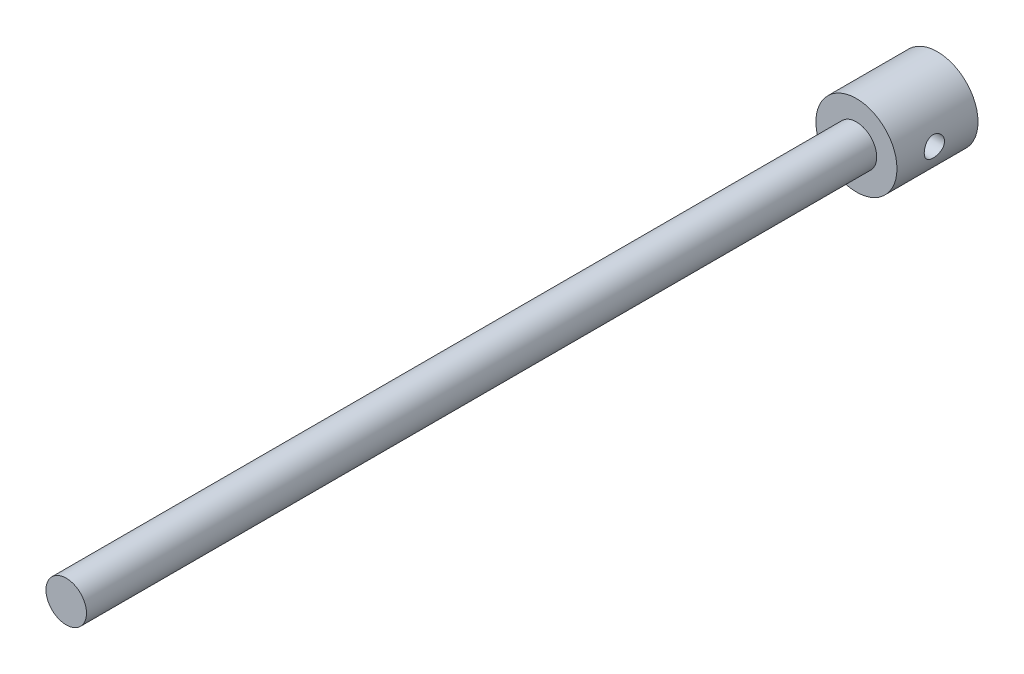
ISO-10303-21;
HEADER;
FILE_DESCRIPTION(('STEP AP214'),'2;1');
FILE_NAME('part.step','',(''),(''),'','','');
FILE_SCHEMA(('AUTOMOTIVE_DESIGN { 1 0 10303 214 1 1 1 1 }'));
ENDSEC;
DATA;
#1=APPLICATION_CONTEXT('core data for automotive mechanical design processes');
#2=APPLICATION_PROTOCOL_DEFINITION('international standard','automotive_design',2000,#1);
#3=PRODUCT_CONTEXT('',#1,'mechanical');
#4=PRODUCT('Part','Part','',(#3));
#5=PRODUCT_RELATED_PRODUCT_CATEGORY('part','',(#4));
#6=PRODUCT_DEFINITION_FORMATION('','',#4);
#7=PRODUCT_DEFINITION_CONTEXT('part definition',#1,'design');
#8=PRODUCT_DEFINITION('design','',#6,#7);
#9=PRODUCT_DEFINITION_SHAPE('','',#8);
#10=(LENGTH_UNIT() NAMED_UNIT(*) SI_UNIT(.MILLI.,.METRE.));
#11=(NAMED_UNIT(*) PLANE_ANGLE_UNIT() SI_UNIT($,.RADIAN.));
#12=(NAMED_UNIT(*) SI_UNIT($,.STERADIAN.) SOLID_ANGLE_UNIT());
#13=UNCERTAINTY_MEASURE_WITH_UNIT(LENGTH_MEASURE(1.E-05),#10,'distance_accuracy_value','');
#14=(GEOMETRIC_REPRESENTATION_CONTEXT(3) GLOBAL_UNCERTAINTY_ASSIGNED_CONTEXT((#13)) GLOBAL_UNIT_ASSIGNED_CONTEXT((#10,
#11,#12)) REPRESENTATION_CONTEXT('',''));
#15=CARTESIAN_POINT('',(0.,0.,0.));
#16=DIRECTION('',(0.,0.,1.));
#17=DIRECTION('',(1.,0.,0.));
#18=AXIS2_PLACEMENT_3D('',#15,#16,#17);
#19=CARTESIAN_POINT('',(0.,0.,50.8));
#20=DIRECTION('',(0.,0.,1.));
#21=DIRECTION('',(1.,0.,0.));
#22=AXIS2_PLACEMENT_3D('',#19,#20,#21);
#23=PLANE('',#22);
#24=CARTESIAN_POINT('',(0.,0.,50.8));
#25=DIRECTION('',(0.,0.,1.));
#26=DIRECTION('',(1.,0.,0.));
#27=AXIS2_PLACEMENT_3D('',#24,#25,#26);
#28=CIRCLE('',#27,25.4);
#29=CARTESIAN_POINT('',(25.4,0.,50.8));
#30=VERTEX_POINT('',#29);
#31=EDGE_CURVE('E47',#30,#30,#28,.T.);
#32=ORIENTED_EDGE('',*,*,#31,.T.);
#33=EDGE_LOOP('',(#32));
#34=FACE_BOUND('',#33,.T.);
#35=CARTESIAN_POINT('',(0.,0.,50.8));
#36=DIRECTION('',(0.,0.,1.));
#37=DIRECTION('',(1.,0.,0.));
#38=AXIS2_PLACEMENT_3D('',#35,#36,#37);
#39=CIRCLE('',#38,12.7);
#40=CARTESIAN_POINT('',(12.7,0.,50.8));
#41=VERTEX_POINT('',#40);
#42=EDGE_CURVE('E83',#41,#41,#39,.T.);
#43=ORIENTED_EDGE('',*,*,#42,.F.);
#44=EDGE_LOOP('',(#43));
#45=FACE_BOUND('',#44,.T.);
#46=ADVANCED_FACE('F32',(#34,#45),#23,.T.);
#47=CARTESIAN_POINT('',(0.,0.,50.8));
#48=DIRECTION('',(0.,0.,-1.));
#49=DIRECTION('',(-1.,0.,0.));
#50=AXIS2_PLACEMENT_3D('',#47,#48,#49);
#51=CYLINDRICAL_SURFACE('',#50,25.4);
#52=CARTESIAN_POINT('',(-25.4,0.,20.9972854039717));
#53=CARTESIAN_POINT('',(-25.4000031710595,0.175477368335688,20.997280166308));
#54=CARTESIAN_POINT('',(-25.3981788556915,0.350897420818033,21.0045602548995));
#55=CARTESIAN_POINT('',(-25.3909395099852,0.700509078087222,21.033607257939));
#56=CARTESIAN_POINT('',(-25.3855240699658,0.874700540422952,21.0553758252559));
#57=CARTESIAN_POINT('',(-25.3712464324763,1.22059137272975,21.1132318736652));
#58=CARTESIAN_POINT('',(-25.3623831657437,1.3922899524397,21.1493237968806));
#59=CARTESIAN_POINT('',(-25.3414514847781,1.73199424315671,21.2355415609955));
#60=CARTESIAN_POINT('',(-25.3293818893422,1.89999856846248,21.2856725742277));
#61=CARTESIAN_POINT('',(-25.3023903485221,2.23081734458719,21.3994702721412));
#62=CARTESIAN_POINT('',(-25.2874729817979,2.39363964336374,21.4631152472046));
#63=CARTESIAN_POINT('',(-25.2551699495027,2.71334043544166,21.6035256297834));
#64=CARTESIAN_POINT('',(-25.2377833730272,2.87021670804385,21.6802958814228));
#65=CARTESIAN_POINT('',(-25.2010173505744,3.17688024593829,21.8463468092333));
#66=CARTESIAN_POINT('',(-25.1816386304114,3.32667006425748,21.9356229333039));
#67=CARTESIAN_POINT('',(-25.141388997849,3.61832024042658,22.1261161881631));
#68=CARTESIAN_POINT('',(-25.1205175257531,3.76017758815662,22.2273378071717));
#69=CARTESIAN_POINT('',(-25.0774522474359,4.03750393287548,22.4429538330606));
#70=CARTESIAN_POINT('',(-25.0552413295654,4.17281051933205,22.5575537597602));
#71=CARTESIAN_POINT('',(-25.010449109414,4.43338729824146,22.7976723640145));
#72=CARTESIAN_POINT('',(-24.9878676727682,4.55865374829687,22.9231950769422));
#73=CARTESIAN_POINT('',(-24.942968931678,4.79824509746214,23.1842665554625));
#74=CARTESIAN_POINT('',(-24.9206515618085,4.91257275871294,23.3198127746237));
#75=CARTESIAN_POINT('',(-24.8768868272122,5.12959684750453,23.60013073647));
#76=CARTESIAN_POINT('',(-24.8554397867069,5.23228896555896,23.7449058664705));
#77=CARTESIAN_POINT('',(-24.8137286118806,5.42668438129292,24.0448627204062));
#78=CARTESIAN_POINT('',(-24.7934861842616,5.51820639937682,24.2001650567364));
#79=CARTESIAN_POINT('',(-24.755120552848,5.68784421693558,24.5182506665807));
#80=CARTESIAN_POINT('',(-24.7369981514456,5.76595494567319,24.6810367402941));
#81=CARTESIAN_POINT('',(-24.7034397392096,5.9080803961254,25.0128442277819));
#82=CARTESIAN_POINT('',(-24.68800239674,5.97210210939067,25.181862500042));
#83=CARTESIAN_POINT('',(-24.6602710489484,6.08558870998768,25.5249655674141));
#84=CARTESIAN_POINT('',(-24.6479781694714,6.13504838447488,25.6990521524086));
#85=CARTESIAN_POINT('',(-24.6168789520224,6.25914374825844,26.2199716952779));
#86=CARTESIAN_POINT('',(-24.6031101485883,6.31252426947526,26.5725680653745));
#87=CARTESIAN_POINT('',(-24.5940009437438,6.34783939503414,27.1040258483282));
#88=CARTESIAN_POINT('',(-24.5928903401882,6.35214485658127,27.2816745339742));
#89=CARTESIAN_POINT('',(-24.5945073780102,6.34588277430792,27.6367137993253));
#90=CARTESIAN_POINT('',(-24.5972350573532,6.33531508337368,27.8141043764601));
#91=CARTESIAN_POINT('',(-24.6108806382161,6.282210717607,28.3352139185138));
#92=CARTESIAN_POINT('',(-24.6271165712381,6.21884460073213,28.6769036859868));
#93=CARTESIAN_POINT('',(-24.6721486694924,6.03768209721243,29.34446037229));
#94=CARTESIAN_POINT('',(-24.7009457295138,5.91988183292792,29.6703261620644));
#95=CARTESIAN_POINT('',(-24.7681803767332,5.63198220323522,30.301028542958));
#96=CARTESIAN_POINT('',(-24.8067123450231,5.46136691279107,30.6056196519554));
#97=CARTESIAN_POINT('',(-24.8890242769867,5.07304154695446,31.1823451552136));
#98=CARTESIAN_POINT('',(-24.9328051583941,4.8553232305771,31.4544738570211));
#99=CARTESIAN_POINT('',(-25.0222123177803,4.37160850403657,31.966712960824));
#100=CARTESIAN_POINT('',(-25.0678556192047,4.10441249538152,32.2056891228183));
#101=CARTESIAN_POINT('',(-25.1547191981976,3.5331904482862,32.6356556194909));
#102=CARTESIAN_POINT('',(-25.1959393406395,3.22916328526542,32.8266444884062));
#103=CARTESIAN_POINT('',(-25.2695173289519,2.5912905991288,33.1556328120175));
#104=CARTESIAN_POINT('',(-25.3018442485759,2.25734624362244,33.293448007071));
#105=CARTESIAN_POINT('',(-25.3537684828018,1.57004175543464,33.5106686687859));
#106=CARTESIAN_POINT('',(-25.3733682323211,1.21668535063703,33.5900853084389));
#107=CARTESIAN_POINT('',(-25.3972694779652,0.510285919246605,33.6865224877304));
#108=CARTESIAN_POINT('',(-25.4019496302995,0.157466278971067,33.7050877734938));
#109=CARTESIAN_POINT('',(-25.3965627053655,-0.546239334332573,33.6835310694871));
#110=CARTESIAN_POINT('',(-25.3864969556011,-0.897125478569813,33.6434143625799));
#111=CARTESIAN_POINT('',(-25.3529923842754,-1.58163313415953,33.5069093927739));
#112=CARTESIAN_POINT('',(-25.3297539457695,-1.91543343305329,33.4113638153538));
#113=CARTESIAN_POINT('',(-25.2725214822312,-2.56225810885606,33.1676623211708));
#114=CARTESIAN_POINT('',(-25.2385263710238,-2.87528038380228,33.0195010912601));
#115=CARTESIAN_POINT('',(-25.1626516754406,-3.47777277441651,32.6718308709794));
#116=CARTESIAN_POINT('',(-25.1206428888929,-3.76672640787545,32.4714573908038));
#117=CARTESIAN_POINT('',(-25.0335780508423,-4.30756129917307,32.0259639197861));
#118=CARTESIAN_POINT('',(-24.9885214742832,-4.55943614542403,31.7808362065123));
#119=CARTESIAN_POINT('',(-24.9217589766669,-4.90717834470799,31.3814434511164));
#120=CARTESIAN_POINT('',(-24.8993709370079,-5.0192686616051,31.2410911054496));
#121=CARTESIAN_POINT('',(-24.8557025906451,-5.23122685203937,30.9513021704156));
#122=CARTESIAN_POINT('',(-24.8344218821867,-5.33109917644899,30.8018689189871));
#123=CARTESIAN_POINT('',(-24.7935782927896,-5.51793758808666,30.4948531517416));
#124=CARTESIAN_POINT('',(-24.7740160378282,-5.6048989801736,30.3372676992805));
#125=CARTESIAN_POINT('',(-24.7372045033632,-5.76519514981392,30.015125966036));
#126=CARTESIAN_POINT('',(-24.7199542962693,-5.83853539673375,29.8505725158823));
#127=CARTESIAN_POINT('',(-24.688370583311,-5.97067425881328,29.5165316866408));
#128=CARTESIAN_POINT('',(-24.6740212417776,-6.02955222433233,29.3470772052707));
#129=CARTESIAN_POINT('',(-24.6485634010713,-6.1327931149458,29.0036330767994));
#130=CARTESIAN_POINT('',(-24.6374536551344,-6.17716162483007,28.8296452025397));
#131=CARTESIAN_POINT('',(-24.6188148175501,-6.25103277930087,28.4783493852618));
#132=CARTESIAN_POINT('',(-24.611285758278,-6.28053528947479,28.3010414122396));
#133=CARTESIAN_POINT('',(-24.6000476746204,-6.32441063496974,27.9444446873736));
#134=CARTESIAN_POINT('',(-24.5963385536064,-6.33878385299868,27.7651559857501));
#135=CARTESIAN_POINT('',(-24.5929088263029,-6.35207673174978,27.4111663244117));
#136=CARTESIAN_POINT('',(-24.5930759770304,-6.35143127769379,27.2364826341427));
#137=CARTESIAN_POINT('',(-24.5971190708759,-6.3357556112654,26.8877471817097));
#138=CARTESIAN_POINT('',(-24.600996219102,-6.32072072481373,26.7136956433268));
#139=CARTESIAN_POINT('',(-24.6123428121949,-6.27639249176991,26.367574631715));
#140=CARTESIAN_POINT('',(-24.6198115229946,-6.24710205880485,26.1955047608152));
#141=CARTESIAN_POINT('',(-24.6381175720356,-6.17450899931628,25.8545285221931));
#142=CARTESIAN_POINT('',(-24.6489549620895,-6.13120615727164,25.6856222031708));
#143=CARTESIAN_POINT('',(-24.6736066272614,-6.03123267697015,25.3531200226926));
#144=CARTESIAN_POINT('',(-24.6874031641975,-5.97464151000922,25.1894989265039));
#145=CARTESIAN_POINT('',(-24.7176104719978,-5.84841340880727,24.867683350238));
#146=CARTESIAN_POINT('',(-24.7340203907627,-5.77878072548574,24.7094871217321));
#147=CARTESIAN_POINT('',(-24.7690064248436,-5.62693434232342,24.3994177636436));
#148=CARTESIAN_POINT('',(-24.7875834904888,-5.54471511810796,24.2475474479912));
#149=CARTESIAN_POINT('',(-24.8263823783131,-5.36832253298905,23.9512086128987));
#150=CARTESIAN_POINT('',(-24.84660366037,-5.27415309205695,23.8067376879867));
#151=CARTESIAN_POINT('',(-24.888703750471,-5.07182215593831,23.5223177351342));
#152=CARTESIAN_POINT('',(-24.9106122575543,-4.96335638560902,23.3825894733589));
#153=CARTESIAN_POINT('',(-24.9549791760033,-4.73524098654736,23.1127613097511));
#154=CARTESIAN_POINT('',(-24.9774373980069,-4.61559517011177,22.9826581527607));
#155=CARTESIAN_POINT('',(-25.0223082296508,-4.3657987735358,22.7327945003161));
#156=CARTESIAN_POINT('',(-25.0447208045122,-4.23564203006343,22.6130401595829));
#157=CARTESIAN_POINT('',(-25.0888678391781,-3.96577795130731,22.3847935531931));
#158=CARTESIAN_POINT('',(-25.1106025427794,-3.82607410870019,22.2762972051483));
#159=CARTESIAN_POINT('',(-25.153203161619,-3.53530097597244,22.0693525237131));
#160=CARTESIAN_POINT('',(-25.1740455087074,-3.38406902835692,21.971127689351));
#161=CARTESIAN_POINT('',(-25.2138259224801,-3.07367149273699,21.7878321450601));
#162=CARTESIAN_POINT('',(-25.232764688416,-2.91450885032487,21.7027565987199));
#163=CARTESIAN_POINT('',(-25.2682002160175,-2.58935741637065,21.5464021967284));
#164=CARTESIAN_POINT('',(-25.2846980295753,-2.42337160480888,21.4751173940637));
#165=CARTESIAN_POINT('',(-25.3147861314922,-2.08575276937432,21.346888511075));
#166=CARTESIAN_POINT('',(-25.3283768584122,-1.9141206018206,21.2899422674165));
#167=CARTESIAN_POINT('',(-25.3596827459723,-1.45814658917184,21.1600223002563));
#168=CARTESIAN_POINT('',(-25.3747073945772,-1.17008430856273,21.0991019624236));
#169=CARTESIAN_POINT('',(-25.3948629939858,-0.58796079008714,21.0177394226912));
#170=CARTESIAN_POINT('',(-25.3999946889197,-0.293900005099015,20.9972941763245));
#171=CARTESIAN_POINT('',(-25.4,0.,20.9972854039717));
#172=B_SPLINE_CURVE_WITH_KNOTS('',3,(#52,#53,#54,#55,#56,#57,#58,#59,#60,#61,#62,#63,#64,#65,
#66,#67,#68,#69,#70,#71,#72,#73,#74,#75,#76,#77,#78,#79,#80,#81,#82,#83,#84,#85,#86,#87,#88,#89,
#90,#91,#92,#93,#94,#95,#96,#97,#98,#99,#100,#101,#102,#103,#104,#105,#106,#107,#108,#109,#110,
#111,#112,#113,#114,#115,#116,#117,#118,#119,#120,#121,#122,#123,#124,#125,#126,#127,#128,#129,
#130,#131,#132,#133,#134,#135,#136,#137,#138,#139,#140,#141,#142,#143,#144,#145,#146,#147,#148,
#149,#150,#151,#152,#153,#154,#155,#156,#157,#158,#159,#160,#161,#162,#163,#164,#165,#166,#167,
#168,#169,#170,#171),.UNSPECIFIED.,.T.,.F.,(4,2,2,2,2,2,2,2,2,2,2,2,2,2,2,2,2,2,2,2,2,2,2,2,2,2,
2,2,2,2,2,2,2,2,2,2,2,2,2,2,2,2,2,2,2,2,2,2,2,2,2,2,2,2,2,2,2,2,2,4),(0.,0.526173121735483,
1.05240628043463,1.57880276827195,2.10539344874169,2.63114449824615,3.15709000634862,
3.68284456692102,4.20879729929497,4.74428380616663,5.27996899287519,5.81551855536606,
6.35126582680285,6.89479488279929,7.43852899384819,7.98199267009452,8.52565065681934,
9.58998829326137,10.1225673422325,10.6551516591026,11.6935230856516,12.7319684924371,
13.780896392369,14.8300079577723,15.9090342533966,16.9880935036739,18.0708590737606,
19.1534174318607,20.2082724578941,21.2630325261476,22.302162333469,23.3413971023517,
24.3990725859747,25.4569307463809,25.9994251838352,26.5417214046517,27.0842143543538,
27.6264890009699,28.1657183254001,28.7047398517696,29.2437662516753,29.7827790161362,
30.3062039140395,30.8297988923205,31.3532869002891,31.8767829602703,32.3972245768341,
32.9174968482737,33.4379981312807,33.9583291160006,34.4924266948309,35.0263428111303,
35.5605743073346,36.0946113977777,36.6385463178219,37.1822806957772,37.7257800727021,
38.2691973997869,39.1505299492341,40.0317962038385),.UNSPECIFIED.);
#173=CARTESIAN_POINT('',(-25.4,0.,20.9972854039717));
#174=VERTEX_POINT('',#173);
#175=EDGE_CURVE('E10',#174,#174,#172,.T.);
#176=ORIENTED_EDGE('',*,*,#175,.T.);
#177=EDGE_LOOP('',(#176));
#178=FACE_BOUND('',#177,.T.);
#179=CARTESIAN_POINT('',(25.4,0.,20.9972854039717));
#180=CARTESIAN_POINT('',(25.4000031710595,-0.175477368335688,20.997280166308));
#181=CARTESIAN_POINT('',(25.3981788556915,-0.350897420818033,21.0045602548995));
#182=CARTESIAN_POINT('',(25.3909395099852,-0.700509078087222,21.033607257939));
#183=CARTESIAN_POINT('',(25.3855240699658,-0.874700540422952,21.0553758252559));
#184=CARTESIAN_POINT('',(25.3712464324763,-1.22059137272975,21.1132318736652));
#185=CARTESIAN_POINT('',(25.3623831657437,-1.3922899524397,21.1493237968806));
#186=CARTESIAN_POINT('',(25.3414514847781,-1.73199424315671,21.2355415609955));
#187=CARTESIAN_POINT('',(25.3293818893422,-1.89999856846248,21.2856725742277));
#188=CARTESIAN_POINT('',(25.3023903485221,-2.23081734458719,21.3994702721412));
#189=CARTESIAN_POINT('',(25.2874729817979,-2.39363964336374,21.4631152472046));
#190=CARTESIAN_POINT('',(25.2551699495027,-2.71334043544166,21.6035256297834));
#191=CARTESIAN_POINT('',(25.2377833730272,-2.87021670804385,21.6802958814228));
#192=CARTESIAN_POINT('',(25.2010173505744,-3.17688024593829,21.8463468092333));
#193=CARTESIAN_POINT('',(25.1816386304114,-3.32667006425748,21.9356229333039));
#194=CARTESIAN_POINT('',(25.141388997849,-3.61832024042658,22.1261161881631));
#195=CARTESIAN_POINT('',(25.1205175257531,-3.76017758815662,22.2273378071717));
#196=CARTESIAN_POINT('',(25.0774522474359,-4.03750393287548,22.4429538330606));
#197=CARTESIAN_POINT('',(25.0552413295654,-4.17281051933205,22.5575537597602));
#198=CARTESIAN_POINT('',(25.010449109414,-4.43338729824146,22.7976723640145));
#199=CARTESIAN_POINT('',(24.9878676727682,-4.55865374829687,22.9231950769422));
#200=CARTESIAN_POINT('',(24.942968931678,-4.79824509746214,23.1842665554625));
#201=CARTESIAN_POINT('',(24.9206515618085,-4.91257275871294,23.3198127746237));
#202=CARTESIAN_POINT('',(24.8768868272122,-5.12959684750453,23.60013073647));
#203=CARTESIAN_POINT('',(24.8554397867069,-5.23228896555896,23.7449058664705));
#204=CARTESIAN_POINT('',(24.8137286118806,-5.42668438129292,24.0448627204062));
#205=CARTESIAN_POINT('',(24.7934861842616,-5.51820639937682,24.2001650567364));
#206=CARTESIAN_POINT('',(24.755120552848,-5.68784421693558,24.5182506665807));
#207=CARTESIAN_POINT('',(24.7369981514456,-5.76595494567319,24.6810367402941));
#208=CARTESIAN_POINT('',(24.7034397392096,-5.9080803961254,25.0128442277819));
#209=CARTESIAN_POINT('',(24.68800239674,-5.97210210939067,25.181862500042));
#210=CARTESIAN_POINT('',(24.6602710489484,-6.08558870998768,25.5249655674141));
#211=CARTESIAN_POINT('',(24.6479781694714,-6.13504838447488,25.6990521524086));
#212=CARTESIAN_POINT('',(24.6168789520224,-6.25914374825844,26.2199716952779));
#213=CARTESIAN_POINT('',(24.6031101485883,-6.31252426947526,26.5725680653745));
#214=CARTESIAN_POINT('',(24.5940009437438,-6.34783939503414,27.1040258483282));
#215=CARTESIAN_POINT('',(24.5928903401882,-6.35214485658127,27.2816745339742));
#216=CARTESIAN_POINT('',(24.5945073780102,-6.34588277430792,27.6367137993253));
#217=CARTESIAN_POINT('',(24.5972350573532,-6.33531508337368,27.8141043764601));
#218=CARTESIAN_POINT('',(24.6108806382161,-6.282210717607,28.3352139185138));
#219=CARTESIAN_POINT('',(24.6271165712381,-6.21884460073213,28.6769036859868));
#220=CARTESIAN_POINT('',(24.6721486694924,-6.03768209721243,29.34446037229));
#221=CARTESIAN_POINT('',(24.7009457295138,-5.91988183292792,29.6703261620644));
#222=CARTESIAN_POINT('',(24.7681803767332,-5.63198220323522,30.301028542958));
#223=CARTESIAN_POINT('',(24.8067123450231,-5.46136691279107,30.6056196519554));
#224=CARTESIAN_POINT('',(24.8890242769867,-5.07304154695446,31.1823451552136));
#225=CARTESIAN_POINT('',(24.9328051583941,-4.8553232305771,31.4544738570211));
#226=CARTESIAN_POINT('',(25.0222123177803,-4.37160850403657,31.966712960824));
#227=CARTESIAN_POINT('',(25.0678556192047,-4.10441249538152,32.2056891228183));
#228=CARTESIAN_POINT('',(25.1547191981976,-3.5331904482862,32.6356556194909));
#229=CARTESIAN_POINT('',(25.1959393406395,-3.22916328526542,32.8266444884062));
#230=CARTESIAN_POINT('',(25.2695173289519,-2.5912905991288,33.1556328120175));
#231=CARTESIAN_POINT('',(25.3018442485759,-2.25734624362244,33.293448007071));
#232=CARTESIAN_POINT('',(25.3537684828018,-1.57004175543464,33.5106686687859));
#233=CARTESIAN_POINT('',(25.3733682323211,-1.21668535063703,33.5900853084389));
#234=CARTESIAN_POINT('',(25.3972694779652,-0.510285919246605,33.6865224877304));
#235=CARTESIAN_POINT('',(25.4019496302995,-0.157466278971067,33.7050877734938));
#236=CARTESIAN_POINT('',(25.3965627053655,0.546239334332573,33.6835310694871));
#237=CARTESIAN_POINT('',(25.3864969556011,0.897125478569813,33.6434143625799));
#238=CARTESIAN_POINT('',(25.3529923842754,1.58163313415953,33.5069093927739));
#239=CARTESIAN_POINT('',(25.3297539457695,1.91543343305329,33.4113638153538));
#240=CARTESIAN_POINT('',(25.2725214822312,2.56225810885606,33.1676623211708));
#241=CARTESIAN_POINT('',(25.2385263710238,2.87528038380228,33.0195010912601));
#242=CARTESIAN_POINT('',(25.1626516754406,3.47777277441651,32.6718308709794));
#243=CARTESIAN_POINT('',(25.1206428888929,3.76672640787545,32.4714573908038));
#244=CARTESIAN_POINT('',(25.0335780508423,4.30756129917307,32.0259639197861));
#245=CARTESIAN_POINT('',(24.9885214742832,4.55943614542403,31.7808362065123));
#246=CARTESIAN_POINT('',(24.9217589766669,4.90717834470799,31.3814434511164));
#247=CARTESIAN_POINT('',(24.8993709370079,5.0192686616051,31.2410911054496));
#248=CARTESIAN_POINT('',(24.8557025906451,5.23122685203937,30.9513021704156));
#249=CARTESIAN_POINT('',(24.8344218821867,5.33109917644899,30.8018689189871));
#250=CARTESIAN_POINT('',(24.7935782927896,5.51793758808666,30.4948531517416));
#251=CARTESIAN_POINT('',(24.7740160378282,5.6048989801736,30.3372676992805));
#252=CARTESIAN_POINT('',(24.7372045033632,5.76519514981392,30.015125966036));
#253=CARTESIAN_POINT('',(24.7199542962693,5.83853539673375,29.8505725158823));
#254=CARTESIAN_POINT('',(24.688370583311,5.97067425881328,29.5165316866408));
#255=CARTESIAN_POINT('',(24.6740212417776,6.02955222433233,29.3470772052707));
#256=CARTESIAN_POINT('',(24.6485634010713,6.1327931149458,29.0036330767994));
#257=CARTESIAN_POINT('',(24.6374536551344,6.17716162483007,28.8296452025397));
#258=CARTESIAN_POINT('',(24.6188148175501,6.25103277930087,28.4783493852618));
#259=CARTESIAN_POINT('',(24.611285758278,6.28053528947479,28.3010414122396));
#260=CARTESIAN_POINT('',(24.6000476746204,6.32441063496974,27.9444446873736));
#261=CARTESIAN_POINT('',(24.5963385536064,6.33878385299868,27.7651559857501));
#262=CARTESIAN_POINT('',(24.5929088263029,6.35207673174978,27.4111663244117));
#263=CARTESIAN_POINT('',(24.5930759770304,6.35143127769379,27.2364826341427));
#264=CARTESIAN_POINT('',(24.5971190708759,6.3357556112654,26.8877471817097));
#265=CARTESIAN_POINT('',(24.600996219102,6.32072072481373,26.7136956433268));
#266=CARTESIAN_POINT('',(24.6123428121949,6.27639249176991,26.367574631715));
#267=CARTESIAN_POINT('',(24.6198115229946,6.24710205880485,26.1955047608152));
#268=CARTESIAN_POINT('',(24.6381175720356,6.17450899931628,25.8545285221931));
#269=CARTESIAN_POINT('',(24.6489549620895,6.13120615727164,25.6856222031708));
#270=CARTESIAN_POINT('',(24.6736066272614,6.03123267697015,25.3531200226926));
#271=CARTESIAN_POINT('',(24.6874031641975,5.97464151000922,25.1894989265039));
#272=CARTESIAN_POINT('',(24.7176104719978,5.84841340880727,24.867683350238));
#273=CARTESIAN_POINT('',(24.7340203907627,5.77878072548574,24.7094871217321));
#274=CARTESIAN_POINT('',(24.7690064248436,5.62693434232342,24.3994177636436));
#275=CARTESIAN_POINT('',(24.7875834904888,5.54471511810796,24.2475474479912));
#276=CARTESIAN_POINT('',(24.8263823783131,5.36832253298905,23.9512086128987));
#277=CARTESIAN_POINT('',(24.84660366037,5.27415309205695,23.8067376879867));
#278=CARTESIAN_POINT('',(24.888703750471,5.07182215593831,23.5223177351342));
#279=CARTESIAN_POINT('',(24.9106122575543,4.96335638560902,23.3825894733589));
#280=CARTESIAN_POINT('',(24.9549791760033,4.73524098654736,23.1127613097511));
#281=CARTESIAN_POINT('',(24.9774373980069,4.61559517011177,22.9826581527607));
#282=CARTESIAN_POINT('',(25.0223082296508,4.3657987735358,22.7327945003161));
#283=CARTESIAN_POINT('',(25.0447208045122,4.23564203006343,22.6130401595829));
#284=CARTESIAN_POINT('',(25.0888678391781,3.96577795130731,22.3847935531931));
#285=CARTESIAN_POINT('',(25.1106025427794,3.82607410870019,22.2762972051483));
#286=CARTESIAN_POINT('',(25.153203161619,3.53530097597244,22.0693525237131));
#287=CARTESIAN_POINT('',(25.1740455087074,3.38406902835692,21.971127689351));
#288=CARTESIAN_POINT('',(25.2138259224801,3.07367149273699,21.7878321450601));
#289=CARTESIAN_POINT('',(25.232764688416,2.91450885032487,21.7027565987199));
#290=CARTESIAN_POINT('',(25.2682002160175,2.58935741637065,21.5464021967284));
#291=CARTESIAN_POINT('',(25.2846980295753,2.42337160480888,21.4751173940637));
#292=CARTESIAN_POINT('',(25.3147861314922,2.08575276937432,21.346888511075));
#293=CARTESIAN_POINT('',(25.3283768584122,1.9141206018206,21.2899422674165));
#294=CARTESIAN_POINT('',(25.3596827459723,1.45814658917184,21.1600223002563));
#295=CARTESIAN_POINT('',(25.3747073945772,1.17008430856273,21.0991019624236));
#296=CARTESIAN_POINT('',(25.3948629939858,0.58796079008714,21.0177394226912));
#297=CARTESIAN_POINT('',(25.3999946889197,0.293900005099015,20.9972941763245));
#298=CARTESIAN_POINT('',(25.4,0.,20.9972854039717));
#299=B_SPLINE_CURVE_WITH_KNOTS('',3,(#179,#180,#181,#182,#183,#184,#185,#186,#187,#188,#189,
#190,#191,#192,#193,#194,#195,#196,#197,#198,#199,#200,#201,#202,#203,#204,#205,#206,#207,#208,
#209,#210,#211,#212,#213,#214,#215,#216,#217,#218,#219,#220,#221,#222,#223,#224,#225,#226,#227,
#228,#229,#230,#231,#232,#233,#234,#235,#236,#237,#238,#239,#240,#241,#242,#243,#244,#245,#246,
#247,#248,#249,#250,#251,#252,#253,#254,#255,#256,#257,#258,#259,#260,#261,#262,#263,#264,#265,
#266,#267,#268,#269,#270,#271,#272,#273,#274,#275,#276,#277,#278,#279,#280,#281,#282,#283,#284,
#285,#286,#287,#288,#289,#290,#291,#292,#293,#294,#295,#296,#297,#298),.UNSPECIFIED.,.T.,.F.,(4,
2,2,2,2,2,2,2,2,2,2,2,2,2,2,2,2,2,2,2,2,2,2,2,2,2,2,2,2,2,2,2,2,2,2,2,2,2,2,2,2,2,2,2,2,2,2,2,2,
2,2,2,2,2,2,2,2,2,2,4),(0.,0.526173121735483,1.05240628043463,1.57880276827195,2.10539344874169,
2.63114449824615,3.15709000634862,3.68284456692102,4.20879729929497,4.74428380616663,
5.27996899287519,5.81551855536606,6.35126582680285,6.89479488279929,7.43852899384819,
7.98199267009452,8.52565065681934,9.58998829326137,10.1225673422325,10.6551516591026,
11.6935230856516,12.7319684924371,13.780896392369,14.8300079577723,15.9090342533966,
16.9880935036739,18.0708590737606,19.1534174318607,20.2082724578941,21.2630325261476,
22.302162333469,23.3413971023517,24.3990725859747,25.4569307463809,25.9994251838352,
26.5417214046517,27.0842143543538,27.6264890009699,28.1657183254001,28.7047398517696,
29.2437662516753,29.7827790161362,30.3062039140395,30.8297988923205,31.3532869002891,
31.8767829602703,32.3972245768341,32.9174968482737,33.4379981312807,33.9583291160006,
34.4924266948309,35.0263428111303,35.5605743073346,36.0946113977777,36.6385463178219,
37.1822806957772,37.7257800727021,38.2691973997869,39.1505299492341,40.0317962038385),.UNSPECIFIED.);
#300=CARTESIAN_POINT('',(25.4,0.,20.9972854039717));
#301=VERTEX_POINT('',#300);
#302=EDGE_CURVE('E43',#301,#301,#299,.T.);
#303=ORIENTED_EDGE('',*,*,#302,.T.);
#304=EDGE_LOOP('',(#303));
#305=FACE_BOUND('',#304,.T.);
#306=ORIENTED_EDGE('',*,*,#31,.F.);
#307=EDGE_LOOP('',(#306));
#308=FACE_BOUND('',#307,.T.);
#309=CARTESIAN_POINT('',(0.,0.,0.));
#310=DIRECTION('',(0.,0.,1.));
#311=DIRECTION('',(1.,0.,0.));
#312=AXIS2_PLACEMENT_3D('',#309,#310,#311);
#313=CIRCLE('',#312,25.4);
#314=CARTESIAN_POINT('',(25.4,0.,0.));
#315=VERTEX_POINT('',#314);
#316=EDGE_CURVE('E51',#315,#315,#313,.T.);
#317=ORIENTED_EDGE('',*,*,#316,.T.);
#318=EDGE_LOOP('',(#317));
#319=FACE_BOUND('',#318,.T.);
#320=ADVANCED_FACE('F34',(#178,#305,#308,#319),#51,.T.);
#321=CARTESIAN_POINT('',(0.,0.,0.));
#322=DIRECTION('',(0.,0.,1.));
#323=DIRECTION('',(1.,0.,0.));
#324=AXIS2_PLACEMENT_3D('',#321,#322,#323);
#325=PLANE('',#324);
#326=ORIENTED_EDGE('',*,*,#316,.F.);
#327=EDGE_LOOP('',(#326));
#328=FACE_BOUND('',#327,.T.);
#329=ADVANCED_FACE('F69',(#328),#325,.F.);
#330=CARTESIAN_POINT('',(0.,0.,546.1));
#331=DIRECTION('',(0.,0.,-1.));
#332=DIRECTION('',(-1.,0.,0.));
#333=AXIS2_PLACEMENT_3D('',#330,#331,#332);
#334=CYLINDRICAL_SURFACE('',#333,12.7);
#335=CARTESIAN_POINT('',(0.,0.,546.1));
#336=DIRECTION('',(0.,0.,1.));
#337=DIRECTION('',(1.,0.,0.));
#338=AXIS2_PLACEMENT_3D('',#335,#336,#337);
#339=CIRCLE('',#338,12.7);
#340=CARTESIAN_POINT('',(12.7,0.,546.1));
#341=VERTEX_POINT('',#340);
#342=EDGE_CURVE('E81',#341,#341,#339,.T.);
#343=ORIENTED_EDGE('',*,*,#342,.F.);
#344=EDGE_LOOP('',(#343));
#345=FACE_BOUND('',#344,.T.);
#346=ORIENTED_EDGE('',*,*,#42,.T.);
#347=EDGE_LOOP('',(#346));
#348=FACE_BOUND('',#347,.T.);
#349=ADVANCED_FACE('F65',(#345,#348),#334,.T.);
#350=CARTESIAN_POINT('',(0.,0.,546.1));
#351=DIRECTION('',(0.,0.,1.));
#352=DIRECTION('',(1.,0.,0.));
#353=AXIS2_PLACEMENT_3D('',#350,#351,#352);
#354=PLANE('',#353);
#355=ORIENTED_EDGE('',*,*,#342,.T.);
#356=EDGE_LOOP('',(#355));
#357=FACE_BOUND('',#356,.T.);
#358=ADVANCED_FACE('F60',(#357),#354,.T.);
#359=CARTESIAN_POINT('',(-25.4,0.,27.3472854039717));
#360=DIRECTION('',(1.,0.,0.));
#361=DIRECTION('',(0.,0.,-1.));
#362=AXIS2_PLACEMENT_3D('',#359,#360,#361);
#363=CYLINDRICAL_SURFACE('',#362,6.35);
#364=ORIENTED_EDGE('',*,*,#302,.F.);
#365=EDGE_LOOP('',(#364));
#366=FACE_BOUND('',#365,.T.);
#367=ORIENTED_EDGE('',*,*,#175,.F.);
#368=EDGE_LOOP('',(#367));
#369=FACE_BOUND('',#368,.T.);
#370=ADVANCED_FACE('F56',(#366,#369),#363,.F.);
#371=CLOSED_SHELL('',(#46,#320,#329,#349,#358,#370));
#372=MANIFOLD_SOLID_BREP('B2',#371);
#373=ADVANCED_BREP_SHAPE_REPRESENTATION('',(#18,#372),#14);
#374=SHAPE_DEFINITION_REPRESENTATION(#9,#373);
ENDSEC;
END-ISO-10303-21;
